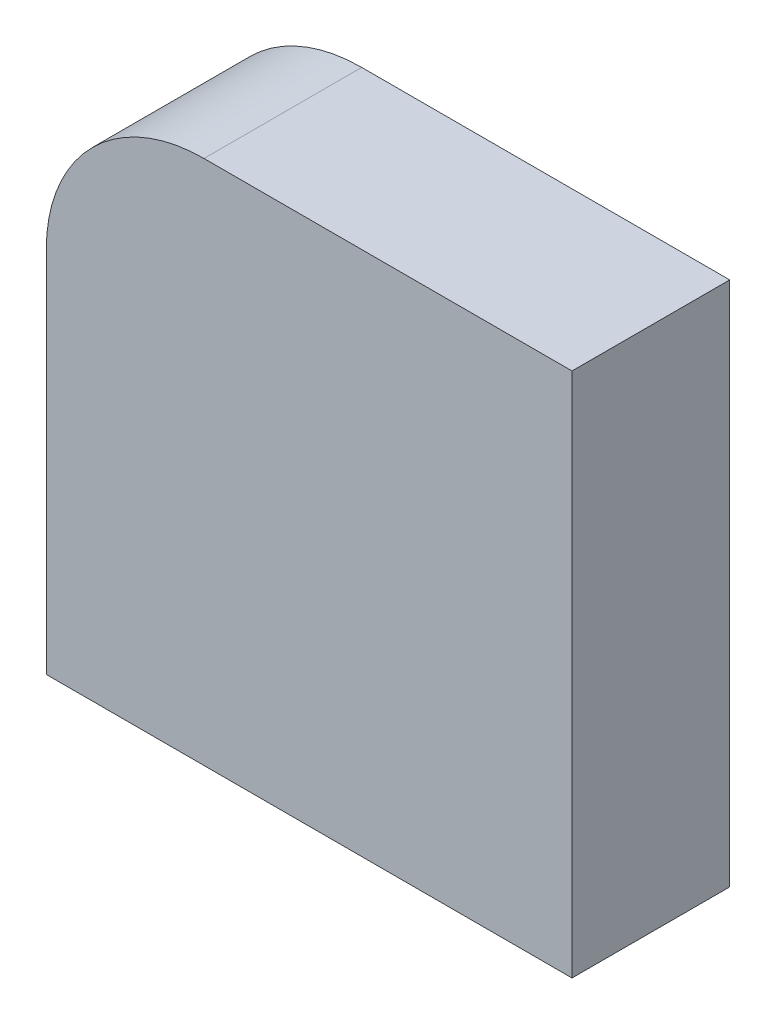
ISO-10303-21;
HEADER;
FILE_DESCRIPTION(('STEP AP214'),'2;1');
FILE_NAME('part.step','',(''),(''),'','','');
FILE_SCHEMA(('AUTOMOTIVE_DESIGN { 1 0 10303 214 1 1 1 1 }'));
ENDSEC;
DATA;
#1=APPLICATION_CONTEXT('core data for automotive mechanical design processes');
#2=APPLICATION_PROTOCOL_DEFINITION('international standard','automotive_design',2000,#1);
#3=PRODUCT_CONTEXT('',#1,'mechanical');
#4=PRODUCT('Part','Part','',(#3));
#5=PRODUCT_RELATED_PRODUCT_CATEGORY('part','',(#4));
#6=PRODUCT_DEFINITION_FORMATION('','',#4);
#7=PRODUCT_DEFINITION_CONTEXT('part definition',#1,'design');
#8=PRODUCT_DEFINITION('design','',#6,#7);
#9=PRODUCT_DEFINITION_SHAPE('','',#8);
#10=(LENGTH_UNIT() NAMED_UNIT(*) SI_UNIT(.MILLI.,.METRE.));
#11=(NAMED_UNIT(*) PLANE_ANGLE_UNIT() SI_UNIT($,.RADIAN.));
#12=(NAMED_UNIT(*) SI_UNIT($,.STERADIAN.) SOLID_ANGLE_UNIT());
#13=UNCERTAINTY_MEASURE_WITH_UNIT(LENGTH_MEASURE(1.E-05),#10,'distance_accuracy_value','');
#14=(GEOMETRIC_REPRESENTATION_CONTEXT(3) GLOBAL_UNCERTAINTY_ASSIGNED_CONTEXT((#13)) GLOBAL_UNIT_ASSIGNED_CONTEXT((#10,
#11,#12)) REPRESENTATION_CONTEXT('',''));
#15=CARTESIAN_POINT('',(0.,0.,0.));
#16=DIRECTION('',(0.,0.,1.));
#17=DIRECTION('',(1.,0.,0.));
#18=AXIS2_PLACEMENT_3D('',#15,#16,#17);
#19=CARTESIAN_POINT('',(-254.,0.,-76.2));
#20=DIRECTION('',(0.,-1.,0.));
#21=DIRECTION('',(0.,0.,-1.));
#22=AXIS2_PLACEMENT_3D('',#19,#20,#21);
#23=PLANE('',#22);
#24=DIRECTION('',(1.,0.,0.));
#25=VECTOR('',#24,1.);
#26=CARTESIAN_POINT('',(-254.,0.,0.));
#27=LINE('',#26,#25);
#28=CARTESIAN_POINT('',(-254.,0.,0.));
#29=VERTEX_POINT('',#28);
#30=CARTESIAN_POINT('',(0.,0.,0.));
#31=VERTEX_POINT('',#30);
#32=EDGE_CURVE('E108',#29,#31,#27,.T.);
#33=ORIENTED_EDGE('',*,*,#32,.F.);
#34=DIRECTION('',(0.,0.,1.));
#35=VECTOR('',#34,1.);
#36=CARTESIAN_POINT('',(-254.,0.,-76.2));
#37=LINE('',#36,#35);
#38=CARTESIAN_POINT('',(-254.,0.,-76.2));
#39=VERTEX_POINT('',#38);
#40=EDGE_CURVE('E11',#39,#29,#37,.T.);
#41=ORIENTED_EDGE('',*,*,#40,.F.);
#42=DIRECTION('',(1.,0.,0.));
#43=VECTOR('',#42,1.);
#44=CARTESIAN_POINT('',(-254.,0.,-76.2));
#45=LINE('',#44,#43);
#46=CARTESIAN_POINT('',(0.,0.,-76.2));
#47=VERTEX_POINT('',#46);
#48=EDGE_CURVE('E103',#39,#47,#45,.T.);
#49=ORIENTED_EDGE('',*,*,#48,.T.);
#50=DIRECTION('',(0.,0.,1.));
#51=VECTOR('',#50,1.);
#52=CARTESIAN_POINT('',(0.,0.,-76.2));
#53=LINE('',#52,#51);
#54=EDGE_CURVE('E34',#47,#31,#53,.T.);
#55=ORIENTED_EDGE('',*,*,#54,.T.);
#56=EDGE_LOOP('',(#33,#41,#49,#55));
#57=FACE_BOUND('',#56,.T.);
#58=ADVANCED_FACE('F31',(#57),#23,.T.);
#59=CARTESIAN_POINT('',(-254.,177.8,-76.2));
#60=DIRECTION('',(-1.,0.,0.));
#61=DIRECTION('',(0.,0.,1.));
#62=AXIS2_PLACEMENT_3D('',#59,#60,#61);
#63=PLANE('',#62);
#64=DIRECTION('',(0.,-1.,0.));
#65=VECTOR('',#64,1.);
#66=CARTESIAN_POINT('',(-254.,177.8,0.));
#67=LINE('',#66,#65);
#68=CARTESIAN_POINT('',(-254.,177.8,0.));
#69=VERTEX_POINT('',#68);
#70=EDGE_CURVE('E117',#69,#29,#67,.T.);
#71=ORIENTED_EDGE('',*,*,#70,.F.);
#72=DIRECTION('',(0.,0.,1.));
#73=VECTOR('',#72,1.);
#74=CARTESIAN_POINT('',(-254.,177.8,-76.2));
#75=LINE('',#74,#73);
#76=CARTESIAN_POINT('',(-254.,177.8,-76.2));
#77=VERTEX_POINT('',#76);
#78=EDGE_CURVE('E40',#77,#69,#75,.T.);
#79=ORIENTED_EDGE('',*,*,#78,.F.);
#80=DIRECTION('',(0.,-1.,0.));
#81=VECTOR('',#80,1.);
#82=CARTESIAN_POINT('',(-254.,177.8,-76.2));
#83=LINE('',#82,#81);
#84=EDGE_CURVE('E98',#77,#39,#83,.T.);
#85=ORIENTED_EDGE('',*,*,#84,.T.);
#86=ORIENTED_EDGE('',*,*,#40,.T.);
#87=EDGE_LOOP('',(#71,#79,#85,#86));
#88=FACE_BOUND('',#87,.T.);
#89=ADVANCED_FACE('F123',(#88),#63,.T.);
#90=CARTESIAN_POINT('',(-177.8,177.8,-76.2));
#91=DIRECTION('',(0.,0.,1.));
#92=DIRECTION('',(1.,0.,0.));
#93=AXIS2_PLACEMENT_3D('',#90,#91,#92);
#94=CYLINDRICAL_SURFACE('',#93,76.2);
#95=CARTESIAN_POINT('',(-177.8,177.8,0.));
#96=DIRECTION('',(0.,0.,1.));
#97=DIRECTION('',(-1.,0.,0.));
#98=AXIS2_PLACEMENT_3D('',#95,#96,#97);
#99=CIRCLE('',#98,76.2);
#100=CARTESIAN_POINT('',(-177.8,254.,0.));
#101=VERTEX_POINT('',#100);
#102=EDGE_CURVE('E87',#101,#69,#99,.T.);
#103=ORIENTED_EDGE('',*,*,#102,.F.);
#104=DIRECTION('',(0.,0.,1.));
#105=VECTOR('',#104,1.);
#106=CARTESIAN_POINT('',(-177.8,254.,-76.2));
#107=LINE('',#106,#105);
#108=CARTESIAN_POINT('',(-177.8,254.,-76.2));
#109=VERTEX_POINT('',#108);
#110=EDGE_CURVE('E82',#109,#101,#107,.T.);
#111=ORIENTED_EDGE('',*,*,#110,.F.);
#112=CARTESIAN_POINT('',(-177.8,177.8,-76.2));
#113=DIRECTION('',(0.,0.,1.));
#114=DIRECTION('',(-1.,0.,0.));
#115=AXIS2_PLACEMENT_3D('',#112,#113,#114);
#116=CIRCLE('',#115,76.2);
#117=EDGE_CURVE('E85',#109,#77,#116,.T.);
#118=ORIENTED_EDGE('',*,*,#117,.T.);
#119=ORIENTED_EDGE('',*,*,#78,.T.);
#120=EDGE_LOOP('',(#103,#111,#118,#119));
#121=FACE_BOUND('',#120,.T.);
#122=ADVANCED_FACE('F84',(#121),#94,.T.);
#123=CARTESIAN_POINT('',(0.,254.,-76.2));
#124=DIRECTION('',(0.,1.,0.));
#125=DIRECTION('',(0.,0.,1.));
#126=AXIS2_PLACEMENT_3D('',#123,#124,#125);
#127=PLANE('',#126);
#128=DIRECTION('',(-1.,0.,0.));
#129=VECTOR('',#128,1.);
#130=CARTESIAN_POINT('',(0.,254.,0.));
#131=LINE('',#130,#129);
#132=CARTESIAN_POINT('',(0.,254.,0.));
#133=VERTEX_POINT('',#132);
#134=EDGE_CURVE('E114',#133,#101,#131,.T.);
#135=ORIENTED_EDGE('',*,*,#134,.F.);
#136=DIRECTION('',(0.,0.,1.));
#137=VECTOR('',#136,1.);
#138=CARTESIAN_POINT('',(0.,254.,-76.2));
#139=LINE('',#138,#137);
#140=CARTESIAN_POINT('',(0.,254.,-76.2));
#141=VERTEX_POINT('',#140);
#142=EDGE_CURVE('E92',#141,#133,#139,.T.);
#143=ORIENTED_EDGE('',*,*,#142,.F.);
#144=DIRECTION('',(-1.,0.,0.));
#145=VECTOR('',#144,1.);
#146=CARTESIAN_POINT('',(0.,254.,-76.2));
#147=LINE('',#146,#145);
#148=EDGE_CURVE('E97',#141,#109,#147,.T.);
#149=ORIENTED_EDGE('',*,*,#148,.T.);
#150=ORIENTED_EDGE('',*,*,#110,.T.);
#151=EDGE_LOOP('',(#135,#143,#149,#150));
#152=FACE_BOUND('',#151,.T.);
#153=ADVANCED_FACE('F100',(#152),#127,.T.);
#154=CARTESIAN_POINT('',(0.,0.,-76.2));
#155=DIRECTION('',(1.,0.,0.));
#156=DIRECTION('',(0.,0.,-1.));
#157=AXIS2_PLACEMENT_3D('',#154,#155,#156);
#158=PLANE('',#157);
#159=DIRECTION('',(0.,1.,0.));
#160=VECTOR('',#159,1.);
#161=CARTESIAN_POINT('',(0.,0.,0.));
#162=LINE('',#161,#160);
#163=EDGE_CURVE('E111',#31,#133,#162,.T.);
#164=ORIENTED_EDGE('',*,*,#163,.F.);
#165=ORIENTED_EDGE('',*,*,#54,.F.);
#166=DIRECTION('',(0.,1.,0.));
#167=VECTOR('',#166,1.);
#168=CARTESIAN_POINT('',(0.,0.,-76.2));
#169=LINE('',#168,#167);
#170=EDGE_CURVE('E101',#47,#141,#169,.T.);
#171=ORIENTED_EDGE('',*,*,#170,.T.);
#172=ORIENTED_EDGE('',*,*,#142,.T.);
#173=EDGE_LOOP('',(#164,#165,#171,#172));
#174=FACE_BOUND('',#173,.T.);
#175=ADVANCED_FACE('F120',(#174),#158,.T.);
#176=CARTESIAN_POINT('',(-177.8,177.8,-76.2));
#177=DIRECTION('',(0.,0.,-1.));
#178=DIRECTION('',(-1.,0.,0.));
#179=AXIS2_PLACEMENT_3D('',#176,#177,#178);
#180=PLANE('',#179);
#181=ORIENTED_EDGE('',*,*,#48,.F.);
#182=ORIENTED_EDGE('',*,*,#84,.F.);
#183=ORIENTED_EDGE('',*,*,#117,.F.);
#184=ORIENTED_EDGE('',*,*,#148,.F.);
#185=ORIENTED_EDGE('',*,*,#170,.F.);
#186=EDGE_LOOP('',(#181,#182,#183,#184,#185));
#187=FACE_BOUND('',#186,.T.);
#188=ADVANCED_FACE('F96',(#187),#180,.T.);
#189=CARTESIAN_POINT('',(-177.8,177.8,0.));
#190=DIRECTION('',(0.,0.,-1.));
#191=DIRECTION('',(-1.,0.,0.));
#192=AXIS2_PLACEMENT_3D('',#189,#190,#191);
#193=PLANE('',#192);
#194=ORIENTED_EDGE('',*,*,#32,.T.);
#195=ORIENTED_EDGE('',*,*,#163,.T.);
#196=ORIENTED_EDGE('',*,*,#134,.T.);
#197=ORIENTED_EDGE('',*,*,#102,.T.);
#198=ORIENTED_EDGE('',*,*,#70,.T.);
#199=EDGE_LOOP('',(#194,#195,#196,#197,#198));
#200=FACE_BOUND('',#199,.T.);
#201=ADVANCED_FACE('F122',(#200),#193,.F.);
#202=CLOSED_SHELL('',(#58,#89,#122,#153,#175,#188,#201));
#203=MANIFOLD_SOLID_BREP('B2',#202);
#204=ADVANCED_BREP_SHAPE_REPRESENTATION('',(#18,#203),#14);
#205=SHAPE_DEFINITION_REPRESENTATION(#9,#204);
ENDSEC;
END-ISO-10303-21;
